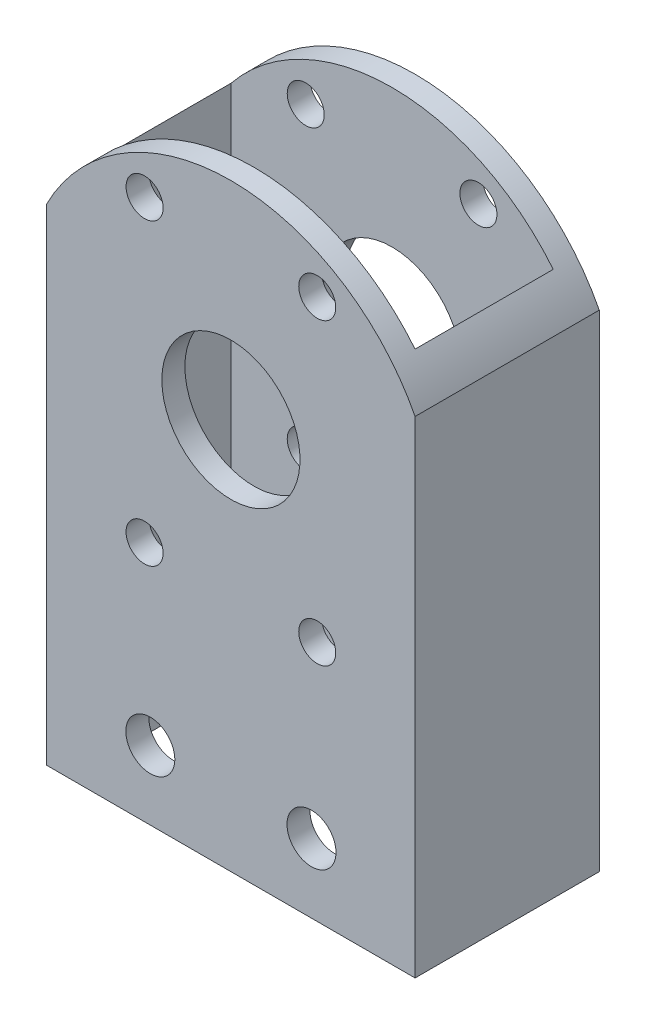
ISO-10303-21;
HEADER;
FILE_DESCRIPTION(('STEP AP214'),'2;1');
FILE_NAME('part.step','',(''),(''),'','','');
FILE_SCHEMA(('AUTOMOTIVE_DESIGN { 1 0 10303 214 1 1 1 1 }'));
ENDSEC;
DATA;
#1=APPLICATION_CONTEXT('core data for automotive mechanical design processes');
#2=APPLICATION_PROTOCOL_DEFINITION('international standard','automotive_design',2000,#1);
#3=PRODUCT_CONTEXT('',#1,'mechanical');
#4=PRODUCT('Part','Part','',(#3));
#5=PRODUCT_RELATED_PRODUCT_CATEGORY('part','',(#4));
#6=PRODUCT_DEFINITION_FORMATION('','',#4);
#7=PRODUCT_DEFINITION_CONTEXT('part definition',#1,'design');
#8=PRODUCT_DEFINITION('design','',#6,#7);
#9=PRODUCT_DEFINITION_SHAPE('','',#8);
#10=(LENGTH_UNIT() NAMED_UNIT(*) SI_UNIT(.MILLI.,.METRE.));
#11=(NAMED_UNIT(*) PLANE_ANGLE_UNIT() SI_UNIT($,.RADIAN.));
#12=(NAMED_UNIT(*) SI_UNIT($,.STERADIAN.) SOLID_ANGLE_UNIT());
#13=UNCERTAINTY_MEASURE_WITH_UNIT(LENGTH_MEASURE(1.E-05),#10,'distance_accuracy_value','');
#14=(GEOMETRIC_REPRESENTATION_CONTEXT(3) GLOBAL_UNCERTAINTY_ASSIGNED_CONTEXT((#13)) GLOBAL_UNIT_ASSIGNED_CONTEXT((#10,
#11,#12)) REPRESENTATION_CONTEXT('',''));
#15=CARTESIAN_POINT('',(0.,0.,0.));
#16=DIRECTION('',(0.,0.,1.));
#17=DIRECTION('',(1.,0.,0.));
#18=AXIS2_PLACEMENT_3D('',#15,#16,#17);
#19=CARTESIAN_POINT('',(-25.4,82.55,-12.7));
#20=DIRECTION('',(0.,0.,1.));
#21=DIRECTION('',(1.,0.,0.));
#22=AXIS2_PLACEMENT_3D('',#19,#20,#21);
#23=PLANE('',#22);
#24=CARTESIAN_POINT('',(-11.1125,9.525,-12.7));
#25=DIRECTION('',(0.,0.,1.));
#26=DIRECTION('',(1.,0.,0.));
#27=AXIS2_PLACEMENT_3D('',#24,#25,#26);
#28=CIRCLE('',#27,3.37819999999999);
#29=CARTESIAN_POINT('',(-7.7343,9.525,-12.7));
#30=VERTEX_POINT('',#29);
#31=EDGE_CURVE('E222',#30,#30,#28,.T.);
#32=ORIENTED_EDGE('',*,*,#31,.T.);
#33=EDGE_LOOP('',(#32));
#34=FACE_BOUND('',#33,.T.);
#35=CARTESIAN_POINT('',(11.1125,9.525,-12.7));
#36=DIRECTION('',(0.,0.,1.));
#37=DIRECTION('',(1.,0.,0.));
#38=AXIS2_PLACEMENT_3D('',#35,#36,#37);
#39=CIRCLE('',#38,3.37819999999999);
#40=CARTESIAN_POINT('',(14.4907,9.525,-12.7));
#41=VERTEX_POINT('',#40);
#42=EDGE_CURVE('E218',#41,#41,#39,.T.);
#43=ORIENTED_EDGE('',*,*,#42,.T.);
#44=EDGE_LOOP('',(#43));
#45=FACE_BOUND('',#44,.T.);
#46=CARTESIAN_POINT('',(0.,53.975,-12.7));
#47=DIRECTION('',(0.,0.,-1.));
#48=DIRECTION('',(-1.,0.,0.));
#49=AXIS2_PLACEMENT_3D('',#46,#47,#48);
#50=CIRCLE('',#49,9.52500000000001);
#51=CARTESIAN_POINT('',(-9.52500000000001,53.975,-12.7));
#52=VERTEX_POINT('',#51);
#53=EDGE_CURVE('E277',#52,#52,#50,.T.);
#54=ORIENTED_EDGE('',*,*,#53,.F.);
#55=EDGE_LOOP('',(#54));
#56=FACE_BOUND('',#55,.T.);
#57=CARTESIAN_POINT('',(11.90625,74.5972299276169,-12.7));
#58=DIRECTION('',(0.,0.,-1.));
#59=DIRECTION('',(-1.,0.,0.));
#60=AXIS2_PLACEMENT_3D('',#57,#58,#59);
#61=CIRCLE('',#60,2.5527);
#62=CARTESIAN_POINT('',(9.35355000000002,74.5972299276169,-12.7));
#63=VERTEX_POINT('',#62);
#64=EDGE_CURVE('E284',#63,#63,#61,.T.);
#65=ORIENTED_EDGE('',*,*,#64,.F.);
#66=EDGE_LOOP('',(#65));
#67=FACE_BOUND('',#66,.T.);
#68=CARTESIAN_POINT('',(-11.90625,74.5972299276169,-12.7));
#69=DIRECTION('',(0.,0.,-1.));
#70=DIRECTION('',(-1.,0.,0.));
#71=AXIS2_PLACEMENT_3D('',#68,#69,#70);
#72=CIRCLE('',#71,2.5527);
#73=CARTESIAN_POINT('',(-14.45895,74.5972299276169,-12.7));
#74=VERTEX_POINT('',#73);
#75=EDGE_CURVE('E291',#74,#74,#72,.T.);
#76=ORIENTED_EDGE('',*,*,#75,.F.);
#77=EDGE_LOOP('',(#76));
#78=FACE_BOUND('',#77,.T.);
#79=CARTESIAN_POINT('',(-11.90625,33.3527700723831,-12.7));
#80=DIRECTION('',(0.,0.,-1.));
#81=DIRECTION('',(-1.,0.,0.));
#82=AXIS2_PLACEMENT_3D('',#79,#80,#81);
#83=CIRCLE('',#82,2.5527);
#84=CARTESIAN_POINT('',(-14.45895,33.3527700723831,-12.7));
#85=VERTEX_POINT('',#84);
#86=EDGE_CURVE('E298',#85,#85,#83,.T.);
#87=ORIENTED_EDGE('',*,*,#86,.F.);
#88=EDGE_LOOP('',(#87));
#89=FACE_BOUND('',#88,.T.);
#90=CARTESIAN_POINT('',(11.90625,33.3527700723831,-12.7));
#91=DIRECTION('',(0.,0.,-1.));
#92=DIRECTION('',(-1.,0.,0.));
#93=AXIS2_PLACEMENT_3D('',#90,#91,#92);
#94=CIRCLE('',#93,2.5527);
#95=CARTESIAN_POINT('',(9.35355000000002,33.3527700723831,-12.7));
#96=VERTEX_POINT('',#95);
#97=EDGE_CURVE('E305',#96,#96,#94,.T.);
#98=ORIENTED_EDGE('',*,*,#97,.F.);
#99=EDGE_LOOP('',(#98));
#100=FACE_BOUND('',#99,.T.);
#101=DIRECTION('',(0.,-1.,0.));
#102=VECTOR('',#101,1.);
#103=CARTESIAN_POINT('',(-25.4,82.55,-12.7));
#104=LINE('',#103,#102);
#105=CARTESIAN_POINT('',(-25.4,67.0658603613361,-12.7));
#106=VERTEX_POINT('',#105);
#107=CARTESIAN_POINT('',(-25.4,0.,-12.7));
#108=VERTEX_POINT('',#107);
#109=EDGE_CURVE('E180',#106,#108,#104,.T.);
#110=ORIENTED_EDGE('',*,*,#109,.F.);
#111=CARTESIAN_POINT('',(0.,53.975,-12.7));
#112=DIRECTION('',(0.,0.,-1.));
#113=DIRECTION('',(-1.,0.,0.));
#114=AXIS2_PLACEMENT_3D('',#111,#112,#113);
#115=CIRCLE('',#114,28.575);
#116=CARTESIAN_POINT('',(25.4,67.065860361336,-12.7));
#117=VERTEX_POINT('',#116);
#118=EDGE_CURVE('E167',#106,#117,#115,.T.);
#119=ORIENTED_EDGE('',*,*,#118,.T.);
#120=DIRECTION('',(0.,-1.,0.));
#121=VECTOR('',#120,1.);
#122=CARTESIAN_POINT('',(25.4,82.55,-12.7));
#123=LINE('',#122,#121);
#124=CARTESIAN_POINT('',(25.4,0.,-12.7));
#125=VERTEX_POINT('',#124);
#126=EDGE_CURVE('E182',#117,#125,#123,.T.);
#127=ORIENTED_EDGE('',*,*,#126,.T.);
#128=DIRECTION('',(-1.,0.,0.));
#129=VECTOR('',#128,1.);
#130=CARTESIAN_POINT('',(-25.4,0.,-12.7));
#131=LINE('',#130,#129);
#132=EDGE_CURVE('E247',#125,#108,#131,.T.);
#133=ORIENTED_EDGE('',*,*,#132,.T.);
#134=EDGE_LOOP('',(#110,#119,#127,#133));
#135=FACE_BOUND('',#134,.T.);
#136=ADVANCED_FACE('F91',(#34,#45,#56,#67,#78,#89,#100,#135),#23,.F.);
#137=CARTESIAN_POINT('',(-25.4,82.55,12.7));
#138=DIRECTION('',(0.,0.,-1.));
#139=DIRECTION('',(-1.,0.,0.));
#140=AXIS2_PLACEMENT_3D('',#137,#138,#139);
#141=PLANE('',#140);
#142=CARTESIAN_POINT('',(-11.1125,9.525,12.7));
#143=DIRECTION('',(0.,0.,1.));
#144=DIRECTION('',(1.,0.,0.));
#145=AXIS2_PLACEMENT_3D('',#142,#143,#144);
#146=CIRCLE('',#145,3.3782);
#147=CARTESIAN_POINT('',(-7.73429999999999,9.525,12.7));
#148=VERTEX_POINT('',#147);
#149=EDGE_CURVE('E263',#148,#148,#146,.T.);
#150=ORIENTED_EDGE('',*,*,#149,.F.);
#151=EDGE_LOOP('',(#150));
#152=FACE_BOUND('',#151,.T.);
#153=CARTESIAN_POINT('',(11.1125,9.525,12.7));
#154=DIRECTION('',(0.,0.,1.));
#155=DIRECTION('',(1.,0.,0.));
#156=AXIS2_PLACEMENT_3D('',#153,#154,#155);
#157=CIRCLE('',#156,3.3782);
#158=CARTESIAN_POINT('',(14.4907,9.525,12.7));
#159=VERTEX_POINT('',#158);
#160=EDGE_CURVE('E270',#159,#159,#157,.T.);
#161=ORIENTED_EDGE('',*,*,#160,.F.);
#162=EDGE_LOOP('',(#161));
#163=FACE_BOUND('',#162,.T.);
#164=CARTESIAN_POINT('',(0.,53.975,12.7));
#165=DIRECTION('',(0.,0.,-1.));
#166=DIRECTION('',(-1.,0.,0.));
#167=AXIS2_PLACEMENT_3D('',#164,#165,#166);
#168=CIRCLE('',#167,9.52500000000001);
#169=CARTESIAN_POINT('',(-9.52500000000001,53.975,12.7));
#170=VERTEX_POINT('',#169);
#171=EDGE_CURVE('E213',#170,#170,#168,.T.);
#172=ORIENTED_EDGE('',*,*,#171,.T.);
#173=EDGE_LOOP('',(#172));
#174=FACE_BOUND('',#173,.T.);
#175=CARTESIAN_POINT('',(11.90625,74.5972299276169,12.7));
#176=DIRECTION('',(0.,0.,-1.));
#177=DIRECTION('',(-1.,0.,0.));
#178=AXIS2_PLACEMENT_3D('',#175,#176,#177);
#179=CIRCLE('',#178,2.55269999999999);
#180=CARTESIAN_POINT('',(9.35355000000002,74.5972299276169,12.7));
#181=VERTEX_POINT('',#180);
#182=EDGE_CURVE('E208',#181,#181,#179,.T.);
#183=ORIENTED_EDGE('',*,*,#182,.T.);
#184=EDGE_LOOP('',(#183));
#185=FACE_BOUND('',#184,.T.);
#186=CARTESIAN_POINT('',(-11.90625,74.5972299276169,12.7));
#187=DIRECTION('',(0.,0.,-1.));
#188=DIRECTION('',(-1.,0.,0.));
#189=AXIS2_PLACEMENT_3D('',#186,#187,#188);
#190=CIRCLE('',#189,2.55269999999999);
#191=CARTESIAN_POINT('',(-14.45895,74.5972299276169,12.7));
#192=VERTEX_POINT('',#191);
#193=EDGE_CURVE('E203',#192,#192,#190,.T.);
#194=ORIENTED_EDGE('',*,*,#193,.T.);
#195=EDGE_LOOP('',(#194));
#196=FACE_BOUND('',#195,.T.);
#197=CARTESIAN_POINT('',(-11.90625,33.3527700723831,12.7));
#198=DIRECTION('',(0.,0.,-1.));
#199=DIRECTION('',(-1.,0.,0.));
#200=AXIS2_PLACEMENT_3D('',#197,#198,#199);
#201=CIRCLE('',#200,2.55269999999999);
#202=CARTESIAN_POINT('',(-14.45895,33.3527700723831,12.7));
#203=VERTEX_POINT('',#202);
#204=EDGE_CURVE('E198',#203,#203,#201,.T.);
#205=ORIENTED_EDGE('',*,*,#204,.T.);
#206=EDGE_LOOP('',(#205));
#207=FACE_BOUND('',#206,.T.);
#208=CARTESIAN_POINT('',(11.90625,33.3527700723831,12.7));
#209=DIRECTION('',(0.,0.,-1.));
#210=DIRECTION('',(-1.,0.,0.));
#211=AXIS2_PLACEMENT_3D('',#208,#209,#210);
#212=CIRCLE('',#211,2.55269999999999);
#213=CARTESIAN_POINT('',(9.35355000000002,33.3527700723831,12.7));
#214=VERTEX_POINT('',#213);
#215=EDGE_CURVE('E193',#214,#214,#212,.T.);
#216=ORIENTED_EDGE('',*,*,#215,.T.);
#217=EDGE_LOOP('',(#216));
#218=FACE_BOUND('',#217,.T.);
#219=CARTESIAN_POINT('',(0.,53.975,12.7));
#220=DIRECTION('',(0.,0.,-1.));
#221=DIRECTION('',(-1.,0.,0.));
#222=AXIS2_PLACEMENT_3D('',#219,#220,#221);
#223=CIRCLE('',#222,28.575);
#224=CARTESIAN_POINT('',(-25.4,67.0658603613361,12.7));
#225=VERTEX_POINT('',#224);
#226=CARTESIAN_POINT('',(25.4,67.065860361336,12.7));
#227=VERTEX_POINT('',#226);
#228=EDGE_CURVE('E156',#225,#227,#223,.T.);
#229=ORIENTED_EDGE('',*,*,#228,.F.);
#230=DIRECTION('',(0.,-1.,0.));
#231=VECTOR('',#230,1.);
#232=CARTESIAN_POINT('',(-25.4,82.55,12.7));
#233=LINE('',#232,#231);
#234=CARTESIAN_POINT('',(-25.4,0.,12.7));
#235=VERTEX_POINT('',#234);
#236=EDGE_CURVE('E161',#225,#235,#233,.T.);
#237=ORIENTED_EDGE('',*,*,#236,.T.);
#238=DIRECTION('',(1.,0.,0.));
#239=VECTOR('',#238,1.);
#240=CARTESIAN_POINT('',(-25.4,0.,12.7));
#241=LINE('',#240,#239);
#242=CARTESIAN_POINT('',(25.4,0.,12.7));
#243=VERTEX_POINT('',#242);
#244=EDGE_CURVE('E184',#235,#243,#241,.T.);
#245=ORIENTED_EDGE('',*,*,#244,.T.);
#246=DIRECTION('',(0.,-1.,0.));
#247=VECTOR('',#246,1.);
#248=CARTESIAN_POINT('',(25.4,82.55,12.7));
#249=LINE('',#248,#247);
#250=EDGE_CURVE('E163',#227,#243,#249,.T.);
#251=ORIENTED_EDGE('',*,*,#250,.F.);
#252=EDGE_LOOP('',(#229,#237,#245,#251));
#253=FACE_BOUND('',#252,.T.);
#254=ADVANCED_FACE('F158',(#152,#163,#174,#185,#196,#207,#218,#253),#141,.F.);
#255=CARTESIAN_POINT('',(0.,82.55,-9.525));
#256=DIRECTION('',(0.,0.,1.));
#257=DIRECTION('',(1.,0.,0.));
#258=AXIS2_PLACEMENT_3D('',#255,#256,#257);
#259=PLANE('',#258);
#260=CARTESIAN_POINT('',(-11.1125,9.525,-9.525));
#261=DIRECTION('',(0.,0.,1.));
#262=DIRECTION('',(1.,0.,0.));
#263=AXIS2_PLACEMENT_3D('',#260,#261,#262);
#264=CIRCLE('',#263,3.3782);
#265=CARTESIAN_POINT('',(-7.7343,9.525,-9.525));
#266=VERTEX_POINT('',#265);
#267=EDGE_CURVE('E219',#266,#266,#264,.T.);
#268=ORIENTED_EDGE('',*,*,#267,.F.);
#269=EDGE_LOOP('',(#268));
#270=FACE_BOUND('',#269,.T.);
#271=CARTESIAN_POINT('',(11.1125,9.525,-9.525));
#272=DIRECTION('',(0.,0.,1.));
#273=DIRECTION('',(1.,0.,0.));
#274=AXIS2_PLACEMENT_3D('',#271,#272,#273);
#275=CIRCLE('',#274,3.3782);
#276=CARTESIAN_POINT('',(14.4907,9.525,-9.525));
#277=VERTEX_POINT('',#276);
#278=EDGE_CURVE('E214',#277,#277,#275,.T.);
#279=ORIENTED_EDGE('',*,*,#278,.F.);
#280=EDGE_LOOP('',(#279));
#281=FACE_BOUND('',#280,.T.);
#282=CARTESIAN_POINT('',(0.,53.975,-9.525));
#283=DIRECTION('',(0.,0.,1.));
#284=DIRECTION('',(1.,0.,0.));
#285=AXIS2_PLACEMENT_3D('',#282,#283,#284);
#286=CIRCLE('',#285,9.52500000000001);
#287=CARTESIAN_POINT('',(9.52500000000001,53.975,-9.525));
#288=VERTEX_POINT('',#287);
#289=EDGE_CURVE('E212',#288,#288,#286,.T.);
#290=ORIENTED_EDGE('',*,*,#289,.F.);
#291=EDGE_LOOP('',(#290));
#292=FACE_BOUND('',#291,.T.);
#293=CARTESIAN_POINT('',(11.90625,74.5972299276169,-9.525));
#294=DIRECTION('',(0.,0.,1.));
#295=DIRECTION('',(1.,0.,0.));
#296=AXIS2_PLACEMENT_3D('',#293,#294,#295);
#297=CIRCLE('',#296,2.5527);
#298=CARTESIAN_POINT('',(14.45895,74.5972299276169,-9.525));
#299=VERTEX_POINT('',#298);
#300=EDGE_CURVE('E207',#299,#299,#297,.T.);
#301=ORIENTED_EDGE('',*,*,#300,.F.);
#302=EDGE_LOOP('',(#301));
#303=FACE_BOUND('',#302,.T.);
#304=CARTESIAN_POINT('',(-11.90625,74.5972299276169,-9.525));
#305=DIRECTION('',(0.,0.,1.));
#306=DIRECTION('',(1.,0.,0.));
#307=AXIS2_PLACEMENT_3D('',#304,#305,#306);
#308=CIRCLE('',#307,2.5527);
#309=CARTESIAN_POINT('',(-9.35355000000002,74.5972299276169,-9.525));
#310=VERTEX_POINT('',#309);
#311=EDGE_CURVE('E199',#310,#310,#308,.T.);
#312=ORIENTED_EDGE('',*,*,#311,.F.);
#313=EDGE_LOOP('',(#312));
#314=FACE_BOUND('',#313,.T.);
#315=CARTESIAN_POINT('',(-11.90625,33.3527700723831,-9.525));
#316=DIRECTION('',(0.,0.,1.));
#317=DIRECTION('',(1.,0.,0.));
#318=AXIS2_PLACEMENT_3D('',#315,#316,#317);
#319=CIRCLE('',#318,2.5527);
#320=CARTESIAN_POINT('',(-9.35355000000002,33.3527700723831,-9.525));
#321=VERTEX_POINT('',#320);
#322=EDGE_CURVE('E197',#321,#321,#319,.T.);
#323=ORIENTED_EDGE('',*,*,#322,.F.);
#324=EDGE_LOOP('',(#323));
#325=FACE_BOUND('',#324,.T.);
#326=CARTESIAN_POINT('',(11.90625,33.3527700723831,-9.525));
#327=DIRECTION('',(0.,0.,1.));
#328=DIRECTION('',(1.,0.,0.));
#329=AXIS2_PLACEMENT_3D('',#326,#327,#328);
#330=CIRCLE('',#329,2.5527);
#331=CARTESIAN_POINT('',(14.45895,33.3527700723831,-9.525));
#332=VERTEX_POINT('',#331);
#333=EDGE_CURVE('E192',#332,#332,#330,.T.);
#334=ORIENTED_EDGE('',*,*,#333,.F.);
#335=EDGE_LOOP('',(#334));
#336=FACE_BOUND('',#335,.T.);
#337=CARTESIAN_POINT('',(0.,53.975,-9.525));
#338=DIRECTION('',(0.,0.,1.));
#339=DIRECTION('',(1.,0.,0.));
#340=AXIS2_PLACEMENT_3D('',#337,#338,#339);
#341=CIRCLE('',#340,28.575);
#342=CARTESIAN_POINT('',(22.225,71.9355122421383,-9.525));
#343=VERTEX_POINT('',#342);
#344=CARTESIAN_POINT('',(-22.225,71.9355122421383,-9.525));
#345=VERTEX_POINT('',#344);
#346=EDGE_CURVE('E258',#343,#345,#341,.T.);
#347=ORIENTED_EDGE('',*,*,#346,.T.);
#348=DIRECTION('',(0.,-1.,0.));
#349=VECTOR('',#348,1.);
#350=CARTESIAN_POINT('',(-22.225,82.55,-9.525));
#351=LINE('',#350,#349);
#352=CARTESIAN_POINT('',(-22.225,0.,-9.525));
#353=VERTEX_POINT('',#352);
#354=EDGE_CURVE('E235',#345,#353,#351,.T.);
#355=ORIENTED_EDGE('',*,*,#354,.T.);
#356=DIRECTION('',(-1.,0.,0.));
#357=VECTOR('',#356,1.);
#358=CARTESIAN_POINT('',(0.,0.,-9.525));
#359=LINE('',#358,#357);
#360=CARTESIAN_POINT('',(22.225,0.,-9.525));
#361=VERTEX_POINT('',#360);
#362=EDGE_CURVE('E313',#361,#353,#359,.T.);
#363=ORIENTED_EDGE('',*,*,#362,.F.);
#364=DIRECTION('',(0.,-1.,0.));
#365=VECTOR('',#364,1.);
#366=CARTESIAN_POINT('',(22.225,82.55,-9.525));
#367=LINE('',#366,#365);
#368=EDGE_CURVE('E242',#343,#361,#367,.T.);
#369=ORIENTED_EDGE('',*,*,#368,.F.);
#370=EDGE_LOOP('',(#347,#355,#363,#369));
#371=FACE_BOUND('',#370,.T.);
#372=ADVANCED_FACE('F322',(#270,#281,#292,#303,#314,#325,#336,#371),#259,.T.);
#373=CARTESIAN_POINT('',(0.,82.55,9.525));
#374=DIRECTION('',(0.,0.,-1.));
#375=DIRECTION('',(-1.,0.,0.));
#376=AXIS2_PLACEMENT_3D('',#373,#374,#375);
#377=PLANE('',#376);
#378=CARTESIAN_POINT('',(-11.1125,9.525,9.525));
#379=DIRECTION('',(0.,0.,-1.));
#380=DIRECTION('',(-1.,0.,0.));
#381=AXIS2_PLACEMENT_3D('',#378,#379,#380);
#382=CIRCLE('',#381,3.3782);
#383=CARTESIAN_POINT('',(-14.4907,9.525,9.525));
#384=VERTEX_POINT('',#383);
#385=EDGE_CURVE('E221',#384,#384,#382,.T.);
#386=ORIENTED_EDGE('',*,*,#385,.F.);
#387=EDGE_LOOP('',(#386));
#388=FACE_BOUND('',#387,.T.);
#389=CARTESIAN_POINT('',(11.1125,9.525,9.525));
#390=DIRECTION('',(0.,0.,-1.));
#391=DIRECTION('',(-1.,0.,0.));
#392=AXIS2_PLACEMENT_3D('',#389,#390,#391);
#393=CIRCLE('',#392,3.3782);
#394=CARTESIAN_POINT('',(7.73430000000001,9.525,9.525));
#395=VERTEX_POINT('',#394);
#396=EDGE_CURVE('E217',#395,#395,#393,.T.);
#397=ORIENTED_EDGE('',*,*,#396,.F.);
#398=EDGE_LOOP('',(#397));
#399=FACE_BOUND('',#398,.T.);
#400=CARTESIAN_POINT('',(0.,53.975,9.525));
#401=DIRECTION('',(0.,0.,-1.));
#402=DIRECTION('',(-1.,0.,0.));
#403=AXIS2_PLACEMENT_3D('',#400,#401,#402);
#404=CIRCLE('',#403,9.52500000000001);
#405=CARTESIAN_POINT('',(-9.52500000000001,53.975,9.525));
#406=VERTEX_POINT('',#405);
#407=EDGE_CURVE('E209',#406,#406,#404,.T.);
#408=ORIENTED_EDGE('',*,*,#407,.F.);
#409=EDGE_LOOP('',(#408));
#410=FACE_BOUND('',#409,.T.);
#411=CARTESIAN_POINT('',(11.90625,74.5972299276169,9.525));
#412=DIRECTION('',(0.,0.,-1.));
#413=DIRECTION('',(-1.,0.,0.));
#414=AXIS2_PLACEMENT_3D('',#411,#412,#413);
#415=CIRCLE('',#414,2.5527);
#416=CARTESIAN_POINT('',(9.35355000000002,74.5972299276169,9.525));
#417=VERTEX_POINT('',#416);
#418=EDGE_CURVE('E204',#417,#417,#415,.T.);
#419=ORIENTED_EDGE('',*,*,#418,.F.);
#420=EDGE_LOOP('',(#419));
#421=FACE_BOUND('',#420,.T.);
#422=CARTESIAN_POINT('',(-11.90625,74.5972299276169,9.525));
#423=DIRECTION('',(0.,0.,-1.));
#424=DIRECTION('',(-1.,0.,0.));
#425=AXIS2_PLACEMENT_3D('',#422,#423,#424);
#426=CIRCLE('',#425,2.5527);
#427=CARTESIAN_POINT('',(-14.45895,74.5972299276169,9.525));
#428=VERTEX_POINT('',#427);
#429=EDGE_CURVE('E202',#428,#428,#426,.T.);
#430=ORIENTED_EDGE('',*,*,#429,.F.);
#431=EDGE_LOOP('',(#430));
#432=FACE_BOUND('',#431,.T.);
#433=CARTESIAN_POINT('',(-11.90625,33.3527700723831,9.525));
#434=DIRECTION('',(0.,0.,-1.));
#435=DIRECTION('',(-1.,0.,0.));
#436=AXIS2_PLACEMENT_3D('',#433,#434,#435);
#437=CIRCLE('',#436,2.5527);
#438=CARTESIAN_POINT('',(-14.45895,33.3527700723831,9.525));
#439=VERTEX_POINT('',#438);
#440=EDGE_CURVE('E194',#439,#439,#437,.T.);
#441=ORIENTED_EDGE('',*,*,#440,.F.);
#442=EDGE_LOOP('',(#441));
#443=FACE_BOUND('',#442,.T.);
#444=CARTESIAN_POINT('',(11.90625,33.3527700723831,9.525));
#445=DIRECTION('',(0.,0.,-1.));
#446=DIRECTION('',(-1.,0.,0.));
#447=AXIS2_PLACEMENT_3D('',#444,#445,#446);
#448=CIRCLE('',#447,2.5527);
#449=CARTESIAN_POINT('',(9.35355000000002,33.3527700723831,9.525));
#450=VERTEX_POINT('',#449);
#451=EDGE_CURVE('E189',#450,#450,#448,.T.);
#452=ORIENTED_EDGE('',*,*,#451,.F.);
#453=EDGE_LOOP('',(#452));
#454=FACE_BOUND('',#453,.T.);
#455=DIRECTION('',(0.,-1.,0.));
#456=VECTOR('',#455,1.);
#457=CARTESIAN_POINT('',(-22.225,82.55,9.525));
#458=LINE('',#457,#456);
#459=CARTESIAN_POINT('',(-22.225,71.9355122421383,9.525));
#460=VERTEX_POINT('',#459);
#461=CARTESIAN_POINT('',(-22.225,0.,9.525));
#462=VERTEX_POINT('',#461);
#463=EDGE_CURVE('E225',#460,#462,#458,.T.);
#464=ORIENTED_EDGE('',*,*,#463,.F.);
#465=CARTESIAN_POINT('',(0.,53.975,9.525));
#466=DIRECTION('',(0.,0.,-1.));
#467=DIRECTION('',(-1.,0.,0.));
#468=AXIS2_PLACEMENT_3D('',#465,#466,#467);
#469=CIRCLE('',#468,28.575);
#470=CARTESIAN_POINT('',(22.225,71.9355122421383,9.525));
#471=VERTEX_POINT('',#470);
#472=EDGE_CURVE('E99',#460,#471,#469,.T.);
#473=ORIENTED_EDGE('',*,*,#472,.T.);
#474=DIRECTION('',(0.,-1.,0.));
#475=VECTOR('',#474,1.);
#476=CARTESIAN_POINT('',(22.225,82.55,9.525));
#477=LINE('',#476,#475);
#478=CARTESIAN_POINT('',(22.225,0.,9.525));
#479=VERTEX_POINT('',#478);
#480=EDGE_CURVE('E113',#471,#479,#477,.T.);
#481=ORIENTED_EDGE('',*,*,#480,.T.);
#482=DIRECTION('',(1.,0.,0.));
#483=VECTOR('',#482,1.);
#484=CARTESIAN_POINT('',(0.,0.,9.525));
#485=LINE('',#484,#483);
#486=EDGE_CURVE('E233',#462,#479,#485,.T.);
#487=ORIENTED_EDGE('',*,*,#486,.F.);
#488=EDGE_LOOP('',(#464,#473,#481,#487));
#489=FACE_BOUND('',#488,.T.);
#490=ADVANCED_FACE('F224',(#388,#399,#410,#421,#432,#443,#454,#489),#377,.T.);
#491=CARTESIAN_POINT('',(-25.4,82.55,12.7));
#492=DIRECTION('',(1.,0.,0.));
#493=DIRECTION('',(0.,0.,-1.));
#494=AXIS2_PLACEMENT_3D('',#491,#492,#493);
#495=PLANE('',#494);
#496=DIRECTION('',(0.,0.,-1.));
#497=VECTOR('',#496,1.);
#498=CARTESIAN_POINT('',(-25.4,67.0658603613361,12.7));
#499=LINE('',#498,#497);
#500=EDGE_CURVE('E170',#225,#106,#499,.T.);
#501=ORIENTED_EDGE('',*,*,#500,.T.);
#502=ORIENTED_EDGE('',*,*,#109,.T.);
#503=DIRECTION('',(0.,0.,1.));
#504=VECTOR('',#503,1.);
#505=CARTESIAN_POINT('',(-25.4,0.,12.7));
#506=LINE('',#505,#504);
#507=EDGE_CURVE('E178',#108,#235,#506,.T.);
#508=ORIENTED_EDGE('',*,*,#507,.T.);
#509=ORIENTED_EDGE('',*,*,#236,.F.);
#510=EDGE_LOOP('',(#501,#502,#508,#509));
#511=FACE_BOUND('',#510,.T.);
#512=ADVANCED_FACE('F176',(#511),#495,.F.);
#513=CARTESIAN_POINT('',(-22.225,82.55,0.));
#514=DIRECTION('',(1.,0.,0.));
#515=DIRECTION('',(0.,0.,-1.));
#516=AXIS2_PLACEMENT_3D('',#513,#514,#515);
#517=PLANE('',#516);
#518=ORIENTED_EDGE('',*,*,#354,.F.);
#519=DIRECTION('',(0.,0.,-1.));
#520=VECTOR('',#519,1.);
#521=CARTESIAN_POINT('',(-22.225,71.9355122421383,12.7));
#522=LINE('',#521,#520);
#523=EDGE_CURVE('E12',#345,#460,#522,.F.);
#524=ORIENTED_EDGE('',*,*,#523,.T.);
#525=ORIENTED_EDGE('',*,*,#463,.T.);
#526=DIRECTION('',(0.,0.,1.));
#527=VECTOR('',#526,1.);
#528=CARTESIAN_POINT('',(-22.225,0.,0.));
#529=LINE('',#528,#527);
#530=EDGE_CURVE('E237',#353,#462,#529,.T.);
#531=ORIENTED_EDGE('',*,*,#530,.F.);
#532=EDGE_LOOP('',(#518,#524,#525,#531));
#533=FACE_BOUND('',#532,.T.);
#534=ADVANCED_FACE('F320',(#533),#517,.T.);
#535=CARTESIAN_POINT('',(25.4,82.55,12.7));
#536=DIRECTION('',(-1.,0.,0.));
#537=DIRECTION('',(0.,0.,1.));
#538=AXIS2_PLACEMENT_3D('',#535,#536,#537);
#539=PLANE('',#538);
#540=DIRECTION('',(0.,0.,-1.));
#541=VECTOR('',#540,1.);
#542=CARTESIAN_POINT('',(25.4,67.065860361336,12.7));
#543=LINE('',#542,#541);
#544=EDGE_CURVE('E166',#227,#117,#543,.T.);
#545=ORIENTED_EDGE('',*,*,#544,.F.);
#546=ORIENTED_EDGE('',*,*,#250,.T.);
#547=DIRECTION('',(0.,0.,-1.));
#548=VECTOR('',#547,1.);
#549=CARTESIAN_POINT('',(25.4,0.,12.7));
#550=LINE('',#549,#548);
#551=EDGE_CURVE('E244',#243,#125,#550,.T.);
#552=ORIENTED_EDGE('',*,*,#551,.T.);
#553=ORIENTED_EDGE('',*,*,#126,.F.);
#554=EDGE_LOOP('',(#545,#546,#552,#553));
#555=FACE_BOUND('',#554,.T.);
#556=ADVANCED_FACE('F93',(#555),#539,.F.);
#557=CARTESIAN_POINT('',(22.225,82.55,0.));
#558=DIRECTION('',(-1.,0.,0.));
#559=DIRECTION('',(0.,0.,1.));
#560=AXIS2_PLACEMENT_3D('',#557,#558,#559);
#561=PLANE('',#560);
#562=ORIENTED_EDGE('',*,*,#480,.F.);
#563=DIRECTION('',(0.,0.,-1.));
#564=VECTOR('',#563,1.);
#565=CARTESIAN_POINT('',(22.225,71.9355122421383,12.7));
#566=LINE('',#565,#564);
#567=EDGE_CURVE('E106',#471,#343,#566,.T.);
#568=ORIENTED_EDGE('',*,*,#567,.T.);
#569=ORIENTED_EDGE('',*,*,#368,.T.);
#570=DIRECTION('',(0.,0.,-1.));
#571=VECTOR('',#570,1.);
#572=CARTESIAN_POINT('',(22.225,0.,0.));
#573=LINE('',#572,#571);
#574=EDGE_CURVE('E231',#479,#361,#573,.T.);
#575=ORIENTED_EDGE('',*,*,#574,.F.);
#576=EDGE_LOOP('',(#562,#568,#569,#575));
#577=FACE_BOUND('',#576,.T.);
#578=ADVANCED_FACE('F228',(#577),#561,.T.);
#579=CARTESIAN_POINT('',(0.,0.,0.));
#580=DIRECTION('',(0.,1.,0.));
#581=DIRECTION('',(0.,0.,1.));
#582=AXIS2_PLACEMENT_3D('',#579,#580,#581);
#583=PLANE('',#582);
#584=ORIENTED_EDGE('',*,*,#551,.F.);
#585=ORIENTED_EDGE('',*,*,#244,.F.);
#586=ORIENTED_EDGE('',*,*,#507,.F.);
#587=ORIENTED_EDGE('',*,*,#132,.F.);
#588=EDGE_LOOP('',(#584,#585,#586,#587));
#589=FACE_BOUND('',#588,.T.);
#590=ORIENTED_EDGE('',*,*,#574,.T.);
#591=ORIENTED_EDGE('',*,*,#362,.T.);
#592=ORIENTED_EDGE('',*,*,#530,.T.);
#593=ORIENTED_EDGE('',*,*,#486,.T.);
#594=EDGE_LOOP('',(#590,#591,#592,#593));
#595=FACE_BOUND('',#594,.T.);
#596=ADVANCED_FACE('F253',(#589,#595),#583,.F.);
#597=CARTESIAN_POINT('',(11.90625,33.3527700723831,-12.7));
#598=DIRECTION('',(0.,0.,-1.));
#599=DIRECTION('',(-1.,0.,0.));
#600=AXIS2_PLACEMENT_3D('',#597,#598,#599);
#601=CYLINDRICAL_SURFACE('',#600,2.5527);
#602=ORIENTED_EDGE('',*,*,#451,.T.);
#603=EDGE_LOOP('',(#602));
#604=FACE_BOUND('',#603,.T.);
#605=ORIENTED_EDGE('',*,*,#215,.F.);
#606=EDGE_LOOP('',(#605));
#607=FACE_BOUND('',#606,.T.);
#608=ADVANCED_FACE('F348',(#604,#607),#601,.F.);
#609=ORIENTED_EDGE('',*,*,#333,.T.);
#610=EDGE_LOOP('',(#609));
#611=FACE_BOUND('',#610,.T.);
#612=ORIENTED_EDGE('',*,*,#97,.T.);
#613=EDGE_LOOP('',(#612));
#614=FACE_BOUND('',#613,.T.);
#615=ADVANCED_FACE('F362',(#611,#614),#601,.F.);
#616=CARTESIAN_POINT('',(-11.90625,33.3527700723831,-12.7));
#617=DIRECTION('',(0.,0.,-1.));
#618=DIRECTION('',(-1.,0.,0.));
#619=AXIS2_PLACEMENT_3D('',#616,#617,#618);
#620=CYLINDRICAL_SURFACE('',#619,2.5527);
#621=ORIENTED_EDGE('',*,*,#440,.T.);
#622=EDGE_LOOP('',(#621));
#623=FACE_BOUND('',#622,.T.);
#624=ORIENTED_EDGE('',*,*,#204,.F.);
#625=EDGE_LOOP('',(#624));
#626=FACE_BOUND('',#625,.T.);
#627=ADVANCED_FACE('F364',(#623,#626),#620,.F.);
#628=ORIENTED_EDGE('',*,*,#322,.T.);
#629=EDGE_LOOP('',(#628));
#630=FACE_BOUND('',#629,.T.);
#631=ORIENTED_EDGE('',*,*,#86,.T.);
#632=EDGE_LOOP('',(#631));
#633=FACE_BOUND('',#632,.T.);
#634=ADVANCED_FACE('F367',(#630,#633),#620,.F.);
#635=CARTESIAN_POINT('',(-11.90625,74.5972299276169,-12.7));
#636=DIRECTION('',(0.,0.,-1.));
#637=DIRECTION('',(-1.,0.,0.));
#638=AXIS2_PLACEMENT_3D('',#635,#636,#637);
#639=CYLINDRICAL_SURFACE('',#638,2.5527);
#640=ORIENTED_EDGE('',*,*,#311,.T.);
#641=EDGE_LOOP('',(#640));
#642=FACE_BOUND('',#641,.T.);
#643=ORIENTED_EDGE('',*,*,#75,.T.);
#644=EDGE_LOOP('',(#643));
#645=FACE_BOUND('',#644,.T.);
#646=ADVANCED_FACE('F369',(#642,#645),#639,.F.);
#647=ORIENTED_EDGE('',*,*,#429,.T.);
#648=EDGE_LOOP('',(#647));
#649=FACE_BOUND('',#648,.T.);
#650=ORIENTED_EDGE('',*,*,#193,.F.);
#651=EDGE_LOOP('',(#650));
#652=FACE_BOUND('',#651,.T.);
#653=ADVANCED_FACE('F372',(#649,#652),#639,.F.);
#654=CARTESIAN_POINT('',(11.90625,74.5972299276169,-12.7));
#655=DIRECTION('',(0.,0.,-1.));
#656=DIRECTION('',(-1.,0.,0.));
#657=AXIS2_PLACEMENT_3D('',#654,#655,#656);
#658=CYLINDRICAL_SURFACE('',#657,2.5527);
#659=ORIENTED_EDGE('',*,*,#418,.T.);
#660=EDGE_LOOP('',(#659));
#661=FACE_BOUND('',#660,.T.);
#662=ORIENTED_EDGE('',*,*,#182,.F.);
#663=EDGE_LOOP('',(#662));
#664=FACE_BOUND('',#663,.T.);
#665=ADVANCED_FACE('F374',(#661,#664),#658,.F.);
#666=ORIENTED_EDGE('',*,*,#300,.T.);
#667=EDGE_LOOP('',(#666));
#668=FACE_BOUND('',#667,.T.);
#669=ORIENTED_EDGE('',*,*,#64,.T.);
#670=EDGE_LOOP('',(#669));
#671=FACE_BOUND('',#670,.T.);
#672=ADVANCED_FACE('F377',(#668,#671),#658,.F.);
#673=CARTESIAN_POINT('',(0.,53.975,12.7));
#674=DIRECTION('',(0.,0.,-1.));
#675=DIRECTION('',(-1.,0.,0.));
#676=AXIS2_PLACEMENT_3D('',#673,#674,#675);
#677=CYLINDRICAL_SURFACE('',#676,9.52500000000001);
#678=ORIENTED_EDGE('',*,*,#407,.T.);
#679=EDGE_LOOP('',(#678));
#680=FACE_BOUND('',#679,.T.);
#681=ORIENTED_EDGE('',*,*,#171,.F.);
#682=EDGE_LOOP('',(#681));
#683=FACE_BOUND('',#682,.T.);
#684=ADVANCED_FACE('F379',(#680,#683),#677,.F.);
#685=ORIENTED_EDGE('',*,*,#289,.T.);
#686=EDGE_LOOP('',(#685));
#687=FACE_BOUND('',#686,.T.);
#688=ORIENTED_EDGE('',*,*,#53,.T.);
#689=EDGE_LOOP('',(#688));
#690=FACE_BOUND('',#689,.T.);
#691=ADVANCED_FACE('F382',(#687,#690),#677,.F.);
#692=CARTESIAN_POINT('',(11.1125,9.525,12.7));
#693=DIRECTION('',(0.,0.,1.));
#694=DIRECTION('',(1.,0.,0.));
#695=AXIS2_PLACEMENT_3D('',#692,#693,#694);
#696=CYLINDRICAL_SURFACE('',#695,3.3782);
#697=ORIENTED_EDGE('',*,*,#278,.T.);
#698=EDGE_LOOP('',(#697));
#699=FACE_BOUND('',#698,.T.);
#700=ORIENTED_EDGE('',*,*,#42,.F.);
#701=EDGE_LOOP('',(#700));
#702=FACE_BOUND('',#701,.T.);
#703=ADVANCED_FACE('F384',(#699,#702),#696,.F.);
#704=ORIENTED_EDGE('',*,*,#396,.T.);
#705=EDGE_LOOP('',(#704));
#706=FACE_BOUND('',#705,.T.);
#707=ORIENTED_EDGE('',*,*,#160,.T.);
#708=EDGE_LOOP('',(#707));
#709=FACE_BOUND('',#708,.T.);
#710=ADVANCED_FACE('F387',(#706,#709),#696,.F.);
#711=CARTESIAN_POINT('',(-11.1125,9.525,12.7));
#712=DIRECTION('',(0.,0.,1.));
#713=DIRECTION('',(1.,0.,0.));
#714=AXIS2_PLACEMENT_3D('',#711,#712,#713);
#715=CYLINDRICAL_SURFACE('',#714,3.3782);
#716=ORIENTED_EDGE('',*,*,#267,.T.);
#717=EDGE_LOOP('',(#716));
#718=FACE_BOUND('',#717,.T.);
#719=ORIENTED_EDGE('',*,*,#31,.F.);
#720=EDGE_LOOP('',(#719));
#721=FACE_BOUND('',#720,.T.);
#722=ADVANCED_FACE('F389',(#718,#721),#715,.F.);
#723=ORIENTED_EDGE('',*,*,#385,.T.);
#724=EDGE_LOOP('',(#723));
#725=FACE_BOUND('',#724,.T.);
#726=ORIENTED_EDGE('',*,*,#149,.T.);
#727=EDGE_LOOP('',(#726));
#728=FACE_BOUND('',#727,.T.);
#729=ADVANCED_FACE('F392',(#725,#728),#715,.F.);
#730=CARTESIAN_POINT('',(0.,53.975,12.7));
#731=DIRECTION('',(0.,0.,-1.));
#732=DIRECTION('',(-1.,0.,0.));
#733=AXIS2_PLACEMENT_3D('',#730,#731,#732);
#734=CYLINDRICAL_SURFACE('',#733,28.575);
#735=ORIENTED_EDGE('',*,*,#118,.F.);
#736=ORIENTED_EDGE('',*,*,#500,.F.);
#737=ORIENTED_EDGE('',*,*,#228,.T.);
#738=ORIENTED_EDGE('',*,*,#544,.T.);
#739=EDGE_LOOP('',(#735,#736,#737,#738));
#740=FACE_BOUND('',#739,.T.);
#741=ORIENTED_EDGE('',*,*,#567,.F.);
#742=ORIENTED_EDGE('',*,*,#472,.F.);
#743=ORIENTED_EDGE('',*,*,#523,.F.);
#744=ORIENTED_EDGE('',*,*,#346,.F.);
#745=EDGE_LOOP('',(#741,#742,#743,#744));
#746=FACE_BOUND('',#745,.T.);
#747=ADVANCED_FACE('F171',(#740,#746),#734,.T.);
#748=CLOSED_SHELL('',(#136,#254,#372,#490,#512,#534,#556,#578,#596,#608,#615,#627,#634,#646,
#653,#665,#672,#684,#691,#703,#710,#722,#729,#747));
#749=MANIFOLD_SOLID_BREP('B2',#748);
#750=ADVANCED_BREP_SHAPE_REPRESENTATION('',(#18,#749),#14);
#751=SHAPE_DEFINITION_REPRESENTATION(#9,#750);
ENDSEC;
END-ISO-10303-21;
